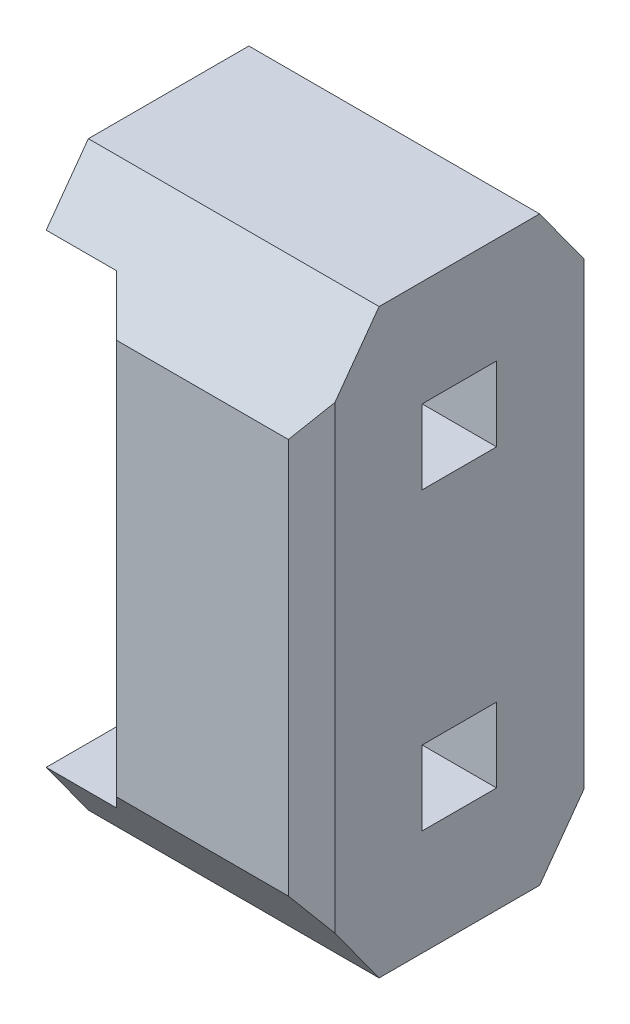
ISO-10303-21;
HEADER;
FILE_DESCRIPTION(('STEP AP214'),'2;1');
FILE_NAME('part.step','',(''),(''),'','','');
FILE_SCHEMA(('AUTOMOTIVE_DESIGN { 1 0 10303 214 1 1 1 1 }'));
ENDSEC;
DATA;
#1=APPLICATION_CONTEXT('core data for automotive mechanical design processes');
#2=APPLICATION_PROTOCOL_DEFINITION('international standard','automotive_design',2000,#1);
#3=PRODUCT_CONTEXT('',#1,'mechanical');
#4=PRODUCT('Part','Part','',(#3));
#5=PRODUCT_RELATED_PRODUCT_CATEGORY('part','',(#4));
#6=PRODUCT_DEFINITION_FORMATION('','',#4);
#7=PRODUCT_DEFINITION_CONTEXT('part definition',#1,'design');
#8=PRODUCT_DEFINITION('design','',#6,#7);
#9=PRODUCT_DEFINITION_SHAPE('','',#8);
#10=(LENGTH_UNIT() NAMED_UNIT(*) SI_UNIT(.MILLI.,.METRE.));
#11=(NAMED_UNIT(*) PLANE_ANGLE_UNIT() SI_UNIT($,.RADIAN.));
#12=(NAMED_UNIT(*) SI_UNIT($,.STERADIAN.) SOLID_ANGLE_UNIT());
#13=UNCERTAINTY_MEASURE_WITH_UNIT(LENGTH_MEASURE(1.E-05),#10,'distance_accuracy_value','');
#14=(GEOMETRIC_REPRESENTATION_CONTEXT(3) GLOBAL_UNCERTAINTY_ASSIGNED_CONTEXT((#13)) GLOBAL_UNIT_ASSIGNED_CONTEXT((#10,
#11,#12)) REPRESENTATION_CONTEXT('',''));
#15=CARTESIAN_POINT('',(0.,0.,0.));
#16=DIRECTION('',(0.,0.,1.));
#17=DIRECTION('',(1.,0.,0.));
#18=AXIS2_PLACEMENT_3D('',#15,#16,#17);
#19=CARTESIAN_POINT('',(1.25,4.6,-23.15));
#20=DIRECTION('',(0.,0.586967571460905,0.809610443394407));
#21=DIRECTION('',(0.,-0.809610443394407,0.586967571460905));
#22=AXIS2_PLACEMENT_3D('',#19,#20,#21);
#23=PLANE('',#22);
#24=DIRECTION('',(1.,0.,0.));
#25=VECTOR('',#24,1.);
#26=CARTESIAN_POINT('',(1.25,4.5,-23.0775));
#27=LINE('',#26,#25);
#28=CARTESIAN_POINT('',(0.,4.5,-23.0775));
#29=VERTEX_POINT('',#28);
#30=CARTESIAN_POINT('',(0.602500000000325,4.5,-23.0775000000001));
#31=VERTEX_POINT('',#30);
#32=EDGE_CURVE('E199',#29,#31,#27,.T.);
#33=ORIENTED_EDGE('',*,*,#32,.T.);
#34=DIRECTION('',(0.506207656348693,-0.698217457033984,0.506207656349605));
#35=VECTOR('',#34,1.);
#36=CARTESIAN_POINT('',(0.6025000000002,4.5,-23.0775));
#37=LINE('',#36,#35);
#38=CARTESIAN_POINT('',(0.819999999999672,4.2,-22.8599999999999));
#39=VERTEX_POINT('',#38);
#40=EDGE_CURVE('E197',#31,#39,#37,.T.);
#41=ORIENTED_EDGE('',*,*,#40,.T.);
#42=DIRECTION('',(1.,0.,0.));
#43=VECTOR('',#42,1.);
#44=CARTESIAN_POINT('',(1.25,4.19999999999999,-22.86));
#45=LINE('',#44,#43);
#46=CARTESIAN_POINT('',(2.30000000000012,4.2,-22.8599999999999));
#47=VERTEX_POINT('',#46);
#48=EDGE_CURVE('E20',#39,#47,#45,.T.);
#49=ORIENTED_EDGE('',*,*,#48,.T.);
#50=DIRECTION('',(0.506207656348955,0.69821745703386,-0.506207656349514));
#51=VECTOR('',#50,1.);
#52=CARTESIAN_POINT('',(2.3,4.19999999999999,-22.86));
#53=LINE('',#52,#51);
#54=CARTESIAN_POINT('',(2.49999999999988,4.47586206896591,-23.0600000000002));
#55=VERTEX_POINT('',#54);
#56=EDGE_CURVE('E181',#47,#55,#53,.T.);
#57=ORIENTED_EDGE('',*,*,#56,.T.);
#58=DIRECTION('',(0.,-0.809610443394407,0.586967571460905));
#59=VECTOR('',#58,1.);
#60=CARTESIAN_POINT('',(2.5,4.6,-23.15));
#61=LINE('',#60,#59);
#62=CARTESIAN_POINT('',(2.5,5.00000000000001,-23.44));
#63=VERTEX_POINT('',#62);
#64=EDGE_CURVE('E188',#55,#63,#61,.F.);
#65=ORIENTED_EDGE('',*,*,#64,.T.);
#66=DIRECTION('',(1.,0.,0.));
#67=VECTOR('',#66,1.);
#68=CARTESIAN_POINT('',(1.25,5.,-23.44));
#69=LINE('',#68,#67);
#70=CARTESIAN_POINT('',(0.,5.00000000000001,-23.44));
#71=VERTEX_POINT('',#70);
#72=EDGE_CURVE('E215',#71,#63,#69,.T.);
#73=ORIENTED_EDGE('',*,*,#72,.F.);
#74=DIRECTION('',(0.,-0.809610443394407,0.586967571460905));
#75=VECTOR('',#74,1.);
#76=CARTESIAN_POINT('',(0.,4.6,-23.15));
#77=LINE('',#76,#75);
#78=EDGE_CURVE('E207',#71,#29,#77,.T.);
#79=ORIENTED_EDGE('',*,*,#78,.T.);
#80=EDGE_LOOP('',(#33,#41,#49,#57,#65,#73,#79));
#81=FACE_BOUND('',#80,.T.);
#82=ADVANCED_FACE('F17',(#81),#23,.T.);
#83=CARTESIAN_POINT('',(1.25,4.6,-25.11));
#84=DIRECTION('',(0.,-0.586967571460905,0.809610443394407));
#85=DIRECTION('',(0.,-0.809610443394407,-0.586967571460905));
#86=AXIS2_PLACEMENT_3D('',#83,#84,#85);
#87=PLANE('',#86);
#88=DIRECTION('',(0.,-0.809610443394407,-0.586967571460905));
#89=VECTOR('',#88,1.);
#90=CARTESIAN_POINT('',(0.,4.6,-25.11));
#91=LINE('',#90,#89);
#92=CARTESIAN_POINT('',(0.,5.,-24.82));
#93=VERTEX_POINT('',#92);
#94=CARTESIAN_POINT('',(0.,4.5,-25.1825));
#95=VERTEX_POINT('',#94);
#96=EDGE_CURVE('E263',#93,#95,#91,.T.);
#97=ORIENTED_EDGE('',*,*,#96,.F.);
#98=DIRECTION('',(1.,0.,0.));
#99=VECTOR('',#98,1.);
#100=CARTESIAN_POINT('',(1.25,5.,-24.82));
#101=LINE('',#100,#99);
#102=CARTESIAN_POINT('',(2.5,5.,-24.82));
#103=VERTEX_POINT('',#102);
#104=EDGE_CURVE('E227',#103,#93,#101,.F.);
#105=ORIENTED_EDGE('',*,*,#104,.F.);
#106=DIRECTION('',(0.,-0.809610443394407,-0.586967571460905));
#107=VECTOR('',#106,1.);
#108=CARTESIAN_POINT('',(2.5,4.6,-25.11));
#109=LINE('',#108,#107);
#110=CARTESIAN_POINT('',(2.49999999999988,4.47586206896591,-25.1999999999998));
#111=VERTEX_POINT('',#110);
#112=EDGE_CURVE('E223',#111,#103,#109,.F.);
#113=ORIENTED_EDGE('',*,*,#112,.F.);
#114=DIRECTION('',(0.506207656348961,0.698217457033859,0.50620765634951));
#115=VECTOR('',#114,1.);
#116=CARTESIAN_POINT('',(2.3,4.19999999999999,-25.4));
#117=LINE('',#116,#115);
#118=CARTESIAN_POINT('',(2.30000000000012,4.2,-25.4000000000001));
#119=VERTEX_POINT('',#118);
#120=EDGE_CURVE('E266',#119,#111,#117,.T.);
#121=ORIENTED_EDGE('',*,*,#120,.F.);
#122=DIRECTION('',(1.,0.,0.));
#123=VECTOR('',#122,1.);
#124=CARTESIAN_POINT('',(1.25,4.19999999999999,-25.4));
#125=LINE('',#124,#123);
#126=CARTESIAN_POINT('',(0.819999999999671,4.2,-25.4000000000001));
#127=VERTEX_POINT('',#126);
#128=EDGE_CURVE('E205',#127,#119,#125,.T.);
#129=ORIENTED_EDGE('',*,*,#128,.F.);
#130=DIRECTION('',(0.506207656348698,-0.698217457033983,-0.506207656349602));
#131=VECTOR('',#130,1.);
#132=CARTESIAN_POINT('',(0.6025000000002,4.5,-25.1825));
#133=LINE('',#132,#131);
#134=CARTESIAN_POINT('',(0.602500000000325,4.5,-25.1824999999999));
#135=VERTEX_POINT('',#134);
#136=EDGE_CURVE('E203',#135,#127,#133,.T.);
#137=ORIENTED_EDGE('',*,*,#136,.F.);
#138=DIRECTION('',(1.,0.,0.));
#139=VECTOR('',#138,1.);
#140=CARTESIAN_POINT('',(1.25,4.5,-25.1825));
#141=LINE('',#140,#139);
#142=EDGE_CURVE('E261',#95,#135,#141,.T.);
#143=ORIENTED_EDGE('',*,*,#142,.F.);
#144=EDGE_LOOP('',(#97,#105,#113,#121,#129,#137,#143));
#145=FACE_BOUND('',#144,.T.);
#146=ADVANCED_FACE('F285',(#145),#87,.F.);
#147=CARTESIAN_POINT('',(1.25,0.4,-25.11));
#148=DIRECTION('',(0.,0.586967571460905,0.809610443394407));
#149=DIRECTION('',(0.,-0.809610443394407,0.586967571460905));
#150=AXIS2_PLACEMENT_3D('',#147,#148,#149);
#151=PLANE('',#150);
#152=DIRECTION('',(-0.506207656349401,0.698217457033646,-0.506207656349363));
#153=VECTOR('',#152,1.);
#154=CARTESIAN_POINT('',(2.5,0.524137931034496,-25.2));
#155=LINE('',#154,#153);
#156=CARTESIAN_POINT('',(2.49999999999988,0.524137931034498,-25.1999999999999));
#157=VERTEX_POINT('',#156);
#158=CARTESIAN_POINT('',(2.30000000000012,0.800000000000005,-25.4000000000001));
#159=VERTEX_POINT('',#158);
#160=EDGE_CURVE('E251',#157,#159,#155,.T.);
#161=ORIENTED_EDGE('',*,*,#160,.F.);
#162=DIRECTION('',(0.,-0.809610443394407,0.586967571460905));
#163=VECTOR('',#162,1.);
#164=CARTESIAN_POINT('',(2.5,0.4,-25.11));
#165=LINE('',#164,#163);
#166=CARTESIAN_POINT('',(2.5,0.,-24.82));
#167=VERTEX_POINT('',#166);
#168=EDGE_CURVE('E253',#167,#157,#165,.F.);
#169=ORIENTED_EDGE('',*,*,#168,.F.);
#170=DIRECTION('',(1.,0.,0.));
#171=VECTOR('',#170,1.);
#172=CARTESIAN_POINT('',(1.25,0.,-24.82));
#173=LINE('',#172,#171);
#174=CARTESIAN_POINT('',(0.,0.,-24.82));
#175=VERTEX_POINT('',#174);
#176=EDGE_CURVE('E288',#167,#175,#173,.F.);
#177=ORIENTED_EDGE('',*,*,#176,.T.);
#178=DIRECTION('',(0.,-0.809610443394407,0.586967571460905));
#179=VECTOR('',#178,1.);
#180=CARTESIAN_POINT('',(0.,0.4,-25.11));
#181=LINE('',#180,#179);
#182=CARTESIAN_POINT('',(0.,0.500000000000001,-25.1825));
#183=VERTEX_POINT('',#182);
#184=EDGE_CURVE('E255',#183,#175,#181,.T.);
#185=ORIENTED_EDGE('',*,*,#184,.F.);
#186=DIRECTION('',(1.,0.,0.));
#187=VECTOR('',#186,1.);
#188=CARTESIAN_POINT('',(1.25,0.500000000000002,-25.1825));
#189=LINE('',#188,#187);
#190=CARTESIAN_POINT('',(0.602500000000325,0.500000000000001,-25.1824999999999));
#191=VERTEX_POINT('',#190);
#192=EDGE_CURVE('E257',#191,#183,#189,.F.);
#193=ORIENTED_EDGE('',*,*,#192,.F.);
#194=DIRECTION('',(-0.506207656348694,-0.698217457033983,0.506207656349606));
#195=VECTOR('',#194,1.);
#196=CARTESIAN_POINT('',(0.8199999999998,0.80000000000001,-25.4));
#197=LINE('',#196,#195);
#198=CARTESIAN_POINT('',(0.819999999999671,0.800000000000005,-25.4000000000001));
#199=VERTEX_POINT('',#198);
#200=EDGE_CURVE('E259',#199,#191,#197,.T.);
#201=ORIENTED_EDGE('',*,*,#200,.F.);
#202=DIRECTION('',(1.,0.,0.));
#203=VECTOR('',#202,1.);
#204=CARTESIAN_POINT('',(1.25,0.80000000000001,-25.4));
#205=LINE('',#204,#203);
#206=EDGE_CURVE('E249',#159,#199,#205,.F.);
#207=ORIENTED_EDGE('',*,*,#206,.F.);
#208=EDGE_LOOP('',(#161,#169,#177,#185,#193,#201,#207));
#209=FACE_BOUND('',#208,.T.);
#210=ADVANCED_FACE('F431',(#209),#151,.F.);
#211=CARTESIAN_POINT('',(1.25,0.4,-23.15));
#212=DIRECTION('',(0.,-0.586967571460905,0.809610443394407));
#213=DIRECTION('',(0.,-0.809610443394407,-0.586967571460905));
#214=AXIS2_PLACEMENT_3D('',#211,#212,#213);
#215=PLANE('',#214);
#216=DIRECTION('',(1.,0.,0.));
#217=VECTOR('',#216,1.);
#218=CARTESIAN_POINT('',(1.25,0.800000000000011,-22.86));
#219=LINE('',#218,#217);
#220=CARTESIAN_POINT('',(2.30000000000012,0.800000000000005,-22.8599999999999));
#221=VERTEX_POINT('',#220);
#222=CARTESIAN_POINT('',(0.819999999999672,0.800000000000005,-22.8599999999999));
#223=VERTEX_POINT('',#222);
#224=EDGE_CURVE('E191',#221,#223,#219,.F.);
#225=ORIENTED_EDGE('',*,*,#224,.T.);
#226=DIRECTION('',(-0.506207656348693,-0.698217457033984,-0.506207656349605));
#227=VECTOR('',#226,1.);
#228=CARTESIAN_POINT('',(0.8199999999998,0.800000000000011,-22.86));
#229=LINE('',#228,#227);
#230=CARTESIAN_POINT('',(0.602500000000325,0.500000000000001,-23.0775000000001));
#231=VERTEX_POINT('',#230);
#232=EDGE_CURVE('E232',#223,#231,#229,.T.);
#233=ORIENTED_EDGE('',*,*,#232,.T.);
#234=DIRECTION('',(1.,0.,0.));
#235=VECTOR('',#234,1.);
#236=CARTESIAN_POINT('',(1.25,0.500000000000002,-23.0775));
#237=LINE('',#236,#235);
#238=CARTESIAN_POINT('',(0.,0.500000000000001,-23.0775));
#239=VERTEX_POINT('',#238);
#240=EDGE_CURVE('E246',#231,#239,#237,.F.);
#241=ORIENTED_EDGE('',*,*,#240,.T.);
#242=DIRECTION('',(0.,-0.809610443394407,-0.586967571460905));
#243=VECTOR('',#242,1.);
#244=CARTESIAN_POINT('',(0.,0.4,-23.15));
#245=LINE('',#244,#243);
#246=CARTESIAN_POINT('',(0.,0.,-23.44));
#247=VERTEX_POINT('',#246);
#248=EDGE_CURVE('E244',#239,#247,#245,.T.);
#249=ORIENTED_EDGE('',*,*,#248,.T.);
#250=DIRECTION('',(1.,0.,0.));
#251=VECTOR('',#250,1.);
#252=CARTESIAN_POINT('',(1.25,0.,-23.44));
#253=LINE('',#252,#251);
#254=CARTESIAN_POINT('',(2.5,0.,-23.44));
#255=VERTEX_POINT('',#254);
#256=EDGE_CURVE('E293',#247,#255,#253,.T.);
#257=ORIENTED_EDGE('',*,*,#256,.T.);
#258=DIRECTION('',(0.,-0.809610443394407,-0.586967571460905));
#259=VECTOR('',#258,1.);
#260=CARTESIAN_POINT('',(2.5,0.4,-23.15));
#261=LINE('',#260,#259);
#262=CARTESIAN_POINT('',(2.49999999999988,0.524137931034498,-23.0600000000001));
#263=VERTEX_POINT('',#262);
#264=EDGE_CURVE('E241',#255,#263,#261,.F.);
#265=ORIENTED_EDGE('',*,*,#264,.T.);
#266=DIRECTION('',(-0.5062076563494,0.698217457033648,0.506207656349362));
#267=VECTOR('',#266,1.);
#268=CARTESIAN_POINT('',(2.5,0.524137931034496,-23.06));
#269=LINE('',#268,#267);
#270=EDGE_CURVE('E239',#263,#221,#269,.T.);
#271=ORIENTED_EDGE('',*,*,#270,.T.);
#272=EDGE_LOOP('',(#225,#233,#241,#249,#257,#265,#271));
#273=FACE_BOUND('',#272,.T.);
#274=ADVANCED_FACE('F421',(#273),#215,.T.);
#275=CARTESIAN_POINT('',(1.25,5.,-24.13));
#276=DIRECTION('',(0.,1.,0.));
#277=DIRECTION('',(0.,0.,1.));
#278=AXIS2_PLACEMENT_3D('',#275,#276,#277);
#279=PLANE('',#278);
#280=ORIENTED_EDGE('',*,*,#104,.T.);
#281=DIRECTION('',(0.,0.,-1.));
#282=VECTOR('',#281,1.);
#283=CARTESIAN_POINT('',(0.,5.,-24.13));
#284=LINE('',#283,#282);
#285=EDGE_CURVE('E231',#93,#71,#284,.F.);
#286=ORIENTED_EDGE('',*,*,#285,.T.);
#287=ORIENTED_EDGE('',*,*,#72,.T.);
#288=DIRECTION('',(0.,0.,1.));
#289=VECTOR('',#288,1.);
#290=CARTESIAN_POINT('',(2.5,5.,-24.13));
#291=LINE('',#290,#289);
#292=EDGE_CURVE('E219',#63,#103,#291,.F.);
#293=ORIENTED_EDGE('',*,*,#292,.T.);
#294=EDGE_LOOP('',(#280,#286,#287,#293));
#295=FACE_BOUND('',#294,.T.);
#296=ADVANCED_FACE('F229',(#295),#279,.T.);
#297=CARTESIAN_POINT('',(1.25,0.,-24.13));
#298=DIRECTION('',(0.,1.,0.));
#299=DIRECTION('',(0.,0.,1.));
#300=AXIS2_PLACEMENT_3D('',#297,#298,#299);
#301=PLANE('',#300);
#302=DIRECTION('',(0.,0.,-1.));
#303=VECTOR('',#302,1.);
#304=CARTESIAN_POINT('',(0.,0.,-24.13));
#305=LINE('',#304,#303);
#306=EDGE_CURVE('E297',#247,#175,#305,.T.);
#307=ORIENTED_EDGE('',*,*,#306,.T.);
#308=ORIENTED_EDGE('',*,*,#176,.F.);
#309=DIRECTION('',(0.,0.,1.));
#310=VECTOR('',#309,1.);
#311=CARTESIAN_POINT('',(2.5,0.,-24.13));
#312=LINE('',#311,#310);
#313=EDGE_CURVE('E287',#255,#167,#312,.F.);
#314=ORIENTED_EDGE('',*,*,#313,.F.);
#315=ORIENTED_EDGE('',*,*,#256,.F.);
#316=EDGE_LOOP('',(#307,#308,#314,#315));
#317=FACE_BOUND('',#316,.T.);
#318=ADVANCED_FACE('F428',(#317),#301,.F.);
#319=CARTESIAN_POINT('',(0.,4.75,-24.13));
#320=DIRECTION('',(1.,0.,0.));
#321=DIRECTION('',(0.,0.,-1.));
#322=AXIS2_PLACEMENT_3D('',#319,#320,#321);
#323=PLANE('',#322);
#324=ORIENTED_EDGE('',*,*,#285,.F.);
#325=ORIENTED_EDGE('',*,*,#96,.T.);
#326=DIRECTION('',(0.,0.,1.));
#327=VECTOR('',#326,1.);
#328=CARTESIAN_POINT('',(0.,4.5,-24.13));
#329=LINE('',#328,#327);
#330=EDGE_CURVE('E307',#95,#29,#329,.T.);
#331=ORIENTED_EDGE('',*,*,#330,.T.);
#332=ORIENTED_EDGE('',*,*,#78,.F.);
#333=EDGE_LOOP('',(#324,#325,#331,#332));
#334=FACE_BOUND('',#333,.T.);
#335=ADVANCED_FACE('F441',(#334),#323,.F.);
#336=CARTESIAN_POINT('',(0.,0.25,-24.13));
#337=DIRECTION('',(1.,0.,0.));
#338=DIRECTION('',(0.,0.,-1.));
#339=AXIS2_PLACEMENT_3D('',#336,#337,#338);
#340=PLANE('',#339);
#341=ORIENTED_EDGE('',*,*,#306,.F.);
#342=ORIENTED_EDGE('',*,*,#248,.F.);
#343=DIRECTION('',(0.,0.,1.));
#344=VECTOR('',#343,1.);
#345=CARTESIAN_POINT('',(0.,0.5,-24.13));
#346=LINE('',#345,#344);
#347=EDGE_CURVE('E315',#183,#239,#346,.T.);
#348=ORIENTED_EDGE('',*,*,#347,.F.);
#349=ORIENTED_EDGE('',*,*,#184,.T.);
#350=EDGE_LOOP('',(#341,#342,#348,#349));
#351=FACE_BOUND('',#350,.T.);
#352=ADVANCED_FACE('F443',(#351),#340,.F.);
#353=CARTESIAN_POINT('',(1.55,3.45,-24.13));
#354=DIRECTION('',(0.,1.,0.));
#355=DIRECTION('',(0.,0.,1.));
#356=AXIS2_PLACEMENT_3D('',#353,#354,#355);
#357=PLANE('',#356);
#358=DIRECTION('',(1.,0.,0.));
#359=VECTOR('',#358,1.);
#360=CARTESIAN_POINT('',(1.55,3.45,-24.45));
#361=LINE('',#360,#359);
#362=CARTESIAN_POINT('',(0.6,3.45,-24.45));
#363=VERTEX_POINT('',#362);
#364=CARTESIAN_POINT('',(2.5,3.45,-24.45));
#365=VERTEX_POINT('',#364);
#366=EDGE_CURVE('E332',#363,#365,#361,.T.);
#367=ORIENTED_EDGE('',*,*,#366,.F.);
#368=DIRECTION('',(0.,0.,1.));
#369=VECTOR('',#368,1.);
#370=CARTESIAN_POINT('',(0.6,3.45,-24.13));
#371=LINE('',#370,#369);
#372=CARTESIAN_POINT('',(0.6,3.45,-23.81));
#373=VERTEX_POINT('',#372);
#374=EDGE_CURVE('E302',#363,#373,#371,.T.);
#375=ORIENTED_EDGE('',*,*,#374,.T.);
#376=DIRECTION('',(1.,0.,0.));
#377=VECTOR('',#376,1.);
#378=CARTESIAN_POINT('',(1.55,3.45,-23.81));
#379=LINE('',#378,#377);
#380=CARTESIAN_POINT('',(2.5,3.45,-23.81));
#381=VERTEX_POINT('',#380);
#382=EDGE_CURVE('E327',#373,#381,#379,.T.);
#383=ORIENTED_EDGE('',*,*,#382,.T.);
#384=DIRECTION('',(0.,0.,1.));
#385=VECTOR('',#384,1.);
#386=CARTESIAN_POINT('',(2.5,3.45,-24.13));
#387=LINE('',#386,#385);
#388=EDGE_CURVE('E300',#381,#365,#387,.F.);
#389=ORIENTED_EDGE('',*,*,#388,.T.);
#390=EDGE_LOOP('',(#367,#375,#383,#389));
#391=FACE_BOUND('',#390,.T.);
#392=ADVANCED_FACE('F398',(#391),#357,.T.);
#393=CARTESIAN_POINT('',(0.71,2.5,-25.29));
#394=DIRECTION('',(0.707106781190498,0.,0.707106781182598));
#395=DIRECTION('',(0.707106781182598,0.,-0.707106781190498));
#396=AXIS2_PLACEMENT_3D('',#393,#394,#395);
#397=PLANE('',#396);
#398=ORIENTED_EDGE('',*,*,#200,.T.);
#399=DIRECTION('',(0.70710678118667,0.,-0.707106781186425));
#400=VECTOR('',#399,1.);
#401=CARTESIAN_POINT('',(0.6000000000002,0.5,-25.18));
#402=LINE('',#401,#400);
#403=CARTESIAN_POINT('',(0.600000000000408,0.5,-25.1799999999997));
#404=VERTEX_POINT('',#403);
#405=EDGE_CURVE('E312',#404,#191,#402,.T.);
#406=ORIENTED_EDGE('',*,*,#405,.F.);
#407=DIRECTION('',(0.,1.,0.));
#408=VECTOR('',#407,1.);
#409=CARTESIAN_POINT('',(0.6,2.5,-25.18));
#410=LINE('',#409,#408);
#411=CARTESIAN_POINT('',(0.600000000000408,4.5,-25.1799999999997));
#412=VERTEX_POINT('',#411);
#413=EDGE_CURVE('E337',#404,#412,#410,.T.);
#414=ORIENTED_EDGE('',*,*,#413,.T.);
#415=DIRECTION('',(0.70710678118667,0.,-0.707106781186425));
#416=VECTOR('',#415,1.);
#417=CARTESIAN_POINT('',(0.6000000000002,4.5,-25.18));
#418=LINE('',#417,#416);
#419=EDGE_CURVE('E304',#412,#135,#418,.T.);
#420=ORIENTED_EDGE('',*,*,#419,.T.);
#421=ORIENTED_EDGE('',*,*,#136,.T.);
#422=DIRECTION('',(0.,1.,0.));
#423=VECTOR('',#422,1.);
#424=CARTESIAN_POINT('',(0.8199999999998,2.5,-25.4));
#425=LINE('',#424,#423);
#426=EDGE_CURVE('E275',#127,#199,#425,.F.);
#427=ORIENTED_EDGE('',*,*,#426,.T.);
#428=EDGE_LOOP('',(#398,#406,#414,#420,#421,#427));
#429=FACE_BOUND('',#428,.T.);
#430=ADVANCED_FACE('F435',(#429),#397,.F.);
#431=CARTESIAN_POINT('',(0.30125,4.5,-24.13));
#432=DIRECTION('',(0.,1.,0.));
#433=DIRECTION('',(0.,0.,1.));
#434=AXIS2_PLACEMENT_3D('',#431,#432,#433);
#435=PLANE('',#434);
#436=ORIENTED_EDGE('',*,*,#142,.T.);
#437=ORIENTED_EDGE('',*,*,#419,.F.);
#438=DIRECTION('',(0.,0.,-1.));
#439=VECTOR('',#438,1.);
#440=CARTESIAN_POINT('',(0.6,4.5,-24.13));
#441=LINE('',#440,#439);
#442=CARTESIAN_POINT('',(0.600000000000279,4.5,-23.0800000000001));
#443=VERTEX_POINT('',#442);
#444=EDGE_CURVE('E339',#412,#443,#441,.F.);
#445=ORIENTED_EDGE('',*,*,#444,.T.);
#446=DIRECTION('',(-0.707106781182598,0.,-0.707106781190498));
#447=VECTOR('',#446,1.);
#448=CARTESIAN_POINT('',(0.71,4.5,-22.97));
#449=LINE('',#448,#447);
#450=EDGE_CURVE('E310',#443,#31,#449,.F.);
#451=ORIENTED_EDGE('',*,*,#450,.T.);
#452=ORIENTED_EDGE('',*,*,#32,.F.);
#453=ORIENTED_EDGE('',*,*,#330,.F.);
#454=EDGE_LOOP('',(#436,#437,#445,#451,#452,#453));
#455=FACE_BOUND('',#454,.T.);
#456=ADVANCED_FACE('F439',(#455),#435,.F.);
#457=CARTESIAN_POINT('',(0.71,2.5,-22.97));
#458=DIRECTION('',(0.707106781190498,0.,-0.707106781182598));
#459=DIRECTION('',(-0.707106781182598,0.,-0.707106781190498));
#460=AXIS2_PLACEMENT_3D('',#457,#458,#459);
#461=PLANE('',#460);
#462=ORIENTED_EDGE('',*,*,#232,.F.);
#463=DIRECTION('',(0.,1.,0.));
#464=VECTOR('',#463,1.);
#465=CARTESIAN_POINT('',(0.8199999999998,2.5,-22.86));
#466=LINE('',#465,#464);
#467=EDGE_CURVE('E325',#39,#223,#466,.F.);
#468=ORIENTED_EDGE('',*,*,#467,.F.);
#469=ORIENTED_EDGE('',*,*,#40,.F.);
#470=ORIENTED_EDGE('',*,*,#450,.F.);
#471=DIRECTION('',(0.,1.,0.));
#472=VECTOR('',#471,1.);
#473=CARTESIAN_POINT('',(0.6,2.5,-23.08));
#474=LINE('',#473,#472);
#475=CARTESIAN_POINT('',(0.600000000000408,0.5,-23.0800000000003));
#476=VERTEX_POINT('',#475);
#477=EDGE_CURVE('E341',#443,#476,#474,.F.);
#478=ORIENTED_EDGE('',*,*,#477,.T.);
#479=DIRECTION('',(-0.70710678118667,0.,-0.707106781186425));
#480=VECTOR('',#479,1.);
#481=CARTESIAN_POINT('',(0.6025000000002,0.5,-23.0775));
#482=LINE('',#481,#480);
#483=EDGE_CURVE('E318',#231,#476,#482,.T.);
#484=ORIENTED_EDGE('',*,*,#483,.F.);
#485=EDGE_LOOP('',(#462,#468,#469,#470,#478,#484));
#486=FACE_BOUND('',#485,.T.);
#487=ADVANCED_FACE('F416',(#486),#461,.F.);
#488=CARTESIAN_POINT('',(0.30125,0.5,-24.13));
#489=DIRECTION('',(0.,1.,0.));
#490=DIRECTION('',(0.,0.,1.));
#491=AXIS2_PLACEMENT_3D('',#488,#489,#490);
#492=PLANE('',#491);
#493=ORIENTED_EDGE('',*,*,#483,.T.);
#494=DIRECTION('',(0.,0.,-1.));
#495=VECTOR('',#494,1.);
#496=CARTESIAN_POINT('',(0.6,0.5,-24.13));
#497=LINE('',#496,#495);
#498=EDGE_CURVE('E343',#476,#404,#497,.T.);
#499=ORIENTED_EDGE('',*,*,#498,.T.);
#500=ORIENTED_EDGE('',*,*,#405,.T.);
#501=ORIENTED_EDGE('',*,*,#192,.T.);
#502=ORIENTED_EDGE('',*,*,#347,.T.);
#503=ORIENTED_EDGE('',*,*,#240,.F.);
#504=EDGE_LOOP('',(#493,#499,#500,#501,#502,#503));
#505=FACE_BOUND('',#504,.T.);
#506=ADVANCED_FACE('F418',(#505),#492,.T.);
#507=CARTESIAN_POINT('',(1.55,1.23,-24.45));
#508=DIRECTION('',(0.,0.,1.));
#509=DIRECTION('',(1.,0.,0.));
#510=AXIS2_PLACEMENT_3D('',#507,#508,#509);
#511=PLANE('',#510);
#512=DIRECTION('',(1.,0.,0.));
#513=VECTOR('',#512,1.);
#514=CARTESIAN_POINT('',(1.55,1.55,-24.45));
#515=LINE('',#514,#513);
#516=CARTESIAN_POINT('',(2.5,1.55,-24.45));
#517=VERTEX_POINT('',#516);
#518=CARTESIAN_POINT('',(0.6,1.55,-24.45));
#519=VERTEX_POINT('',#518);
#520=EDGE_CURVE('E283',#517,#519,#515,.F.);
#521=ORIENTED_EDGE('',*,*,#520,.T.);
#522=DIRECTION('',(0.,1.,0.));
#523=VECTOR('',#522,1.);
#524=CARTESIAN_POINT('',(0.6,2.5,-24.45));
#525=LINE('',#524,#523);
#526=CARTESIAN_POINT('',(0.6,0.91,-24.45));
#527=VERTEX_POINT('',#526);
#528=EDGE_CURVE('E346',#519,#527,#525,.F.);
#529=ORIENTED_EDGE('',*,*,#528,.T.);
#530=DIRECTION('',(1.,0.,0.));
#531=VECTOR('',#530,1.);
#532=CARTESIAN_POINT('',(1.55,0.91,-24.45));
#533=LINE('',#532,#531);
#534=CARTESIAN_POINT('',(2.5,0.91,-24.45));
#535=VERTEX_POINT('',#534);
#536=EDGE_CURVE('E354',#535,#527,#533,.F.);
#537=ORIENTED_EDGE('',*,*,#536,.F.);
#538=DIRECTION('',(0.,1.,0.));
#539=VECTOR('',#538,1.);
#540=CARTESIAN_POINT('',(2.5,1.23,-24.45));
#541=LINE('',#540,#539);
#542=EDGE_CURVE('E321',#535,#517,#541,.T.);
#543=ORIENTED_EDGE('',*,*,#542,.T.);
#544=EDGE_LOOP('',(#521,#529,#537,#543));
#545=FACE_BOUND('',#544,.T.);
#546=ADVANCED_FACE('F483',(#545),#511,.T.);
#547=CARTESIAN_POINT('',(1.56,2.5,-25.4));
#548=DIRECTION('',(0.,0.,1.));
#549=DIRECTION('',(1.,0.,0.));
#550=AXIS2_PLACEMENT_3D('',#547,#548,#549);
#551=PLANE('',#550);
#552=DIRECTION('',(0.,1.,0.));
#553=VECTOR('',#552,1.);
#554=CARTESIAN_POINT('',(2.30000000000047,2.5,-25.4000000000005));
#555=LINE('',#554,#553);
#556=EDGE_CURVE('E193',#159,#119,#555,.T.);
#557=ORIENTED_EDGE('',*,*,#556,.F.);
#558=ORIENTED_EDGE('',*,*,#206,.T.);
#559=ORIENTED_EDGE('',*,*,#426,.F.);
#560=ORIENTED_EDGE('',*,*,#128,.T.);
#561=EDGE_LOOP('',(#557,#558,#559,#560));
#562=FACE_BOUND('',#561,.T.);
#563=ADVANCED_FACE('F272',(#562),#551,.F.);
#564=CARTESIAN_POINT('',(1.56,2.5,-22.86));
#565=DIRECTION('',(0.,0.,1.));
#566=DIRECTION('',(1.,0.,0.));
#567=AXIS2_PLACEMENT_3D('',#564,#565,#566);
#568=PLANE('',#567);
#569=ORIENTED_EDGE('',*,*,#48,.F.);
#570=ORIENTED_EDGE('',*,*,#467,.T.);
#571=ORIENTED_EDGE('',*,*,#224,.F.);
#572=DIRECTION('',(0.,1.,0.));
#573=VECTOR('',#572,1.);
#574=CARTESIAN_POINT('',(2.30000000000047,2.5,-22.8599999999995));
#575=LINE('',#574,#573);
#576=EDGE_CURVE('E183',#47,#221,#575,.F.);
#577=ORIENTED_EDGE('',*,*,#576,.F.);
#578=EDGE_LOOP('',(#569,#570,#571,#577));
#579=FACE_BOUND('',#578,.T.);
#580=ADVANCED_FACE('F189',(#579),#568,.T.);
#581=CARTESIAN_POINT('',(1.55,3.77,-23.81));
#582=DIRECTION('',(0.,0.,1.));
#583=DIRECTION('',(1.,0.,0.));
#584=AXIS2_PLACEMENT_3D('',#581,#582,#583);
#585=PLANE('',#584);
#586=DIRECTION('',(0.,1.,0.));
#587=VECTOR('',#586,1.);
#588=CARTESIAN_POINT('',(2.5,3.77,-23.81));
#589=LINE('',#588,#587);
#590=CARTESIAN_POINT('',(2.5,4.09,-23.81));
#591=VERTEX_POINT('',#590);
#592=EDGE_CURVE('E330',#381,#591,#589,.T.);
#593=ORIENTED_EDGE('',*,*,#592,.F.);
#594=ORIENTED_EDGE('',*,*,#382,.F.);
#595=DIRECTION('',(0.,1.,0.));
#596=VECTOR('',#595,1.);
#597=CARTESIAN_POINT('',(0.6,2.5,-23.81));
#598=LINE('',#597,#596);
#599=CARTESIAN_POINT('',(0.6,4.09,-23.81));
#600=VERTEX_POINT('',#599);
#601=EDGE_CURVE('E351',#373,#600,#598,.T.);
#602=ORIENTED_EDGE('',*,*,#601,.T.);
#603=DIRECTION('',(1.,0.,0.));
#604=VECTOR('',#603,1.);
#605=CARTESIAN_POINT('',(1.55,4.09,-23.81));
#606=LINE('',#605,#604);
#607=EDGE_CURVE('E368',#600,#591,#606,.T.);
#608=ORIENTED_EDGE('',*,*,#607,.T.);
#609=EDGE_LOOP('',(#593,#594,#602,#608));
#610=FACE_BOUND('',#609,.T.);
#611=ADVANCED_FACE('F402',(#610),#585,.F.);
#612=CARTESIAN_POINT('',(1.55,3.77,-24.45));
#613=DIRECTION('',(0.,0.,1.));
#614=DIRECTION('',(1.,0.,0.));
#615=AXIS2_PLACEMENT_3D('',#612,#613,#614);
#616=PLANE('',#615);
#617=DIRECTION('',(1.,0.,0.));
#618=VECTOR('',#617,1.);
#619=CARTESIAN_POINT('',(1.55,4.09,-24.45));
#620=LINE('',#619,#618);
#621=CARTESIAN_POINT('',(2.5,4.09,-24.45));
#622=VERTEX_POINT('',#621);
#623=CARTESIAN_POINT('',(0.6,4.09,-24.45));
#624=VERTEX_POINT('',#623);
#625=EDGE_CURVE('E371',#622,#624,#620,.F.);
#626=ORIENTED_EDGE('',*,*,#625,.T.);
#627=DIRECTION('',(0.,1.,0.));
#628=VECTOR('',#627,1.);
#629=CARTESIAN_POINT('',(0.6,2.5,-24.45));
#630=LINE('',#629,#628);
#631=EDGE_CURVE('E348',#624,#363,#630,.F.);
#632=ORIENTED_EDGE('',*,*,#631,.T.);
#633=ORIENTED_EDGE('',*,*,#366,.T.);
#634=DIRECTION('',(0.,1.,0.));
#635=VECTOR('',#634,1.);
#636=CARTESIAN_POINT('',(2.5,3.77,-24.45));
#637=LINE('',#636,#635);
#638=EDGE_CURVE('E335',#365,#622,#637,.T.);
#639=ORIENTED_EDGE('',*,*,#638,.T.);
#640=EDGE_LOOP('',(#626,#632,#633,#639));
#641=FACE_BOUND('',#640,.T.);
#642=ADVANCED_FACE('F395',(#641),#616,.T.);
#643=CARTESIAN_POINT('',(0.6,2.5,-24.13));
#644=DIRECTION('',(1.,0.,0.));
#645=DIRECTION('',(0.,0.,-1.));
#646=AXIS2_PLACEMENT_3D('',#643,#644,#645);
#647=PLANE('',#646);
#648=ORIENTED_EDGE('',*,*,#374,.F.);
#649=ORIENTED_EDGE('',*,*,#631,.F.);
#650=DIRECTION('',(0.,0.,1.));
#651=VECTOR('',#650,1.);
#652=CARTESIAN_POINT('',(0.6,4.09,-24.13));
#653=LINE('',#652,#651);
#654=EDGE_CURVE('E192',#624,#600,#653,.T.);
#655=ORIENTED_EDGE('',*,*,#654,.T.);
#656=ORIENTED_EDGE('',*,*,#601,.F.);
#657=EDGE_LOOP('',(#648,#649,#655,#656));
#658=FACE_BOUND('',#657,.T.);
#659=ORIENTED_EDGE('',*,*,#528,.F.);
#660=DIRECTION('',(0.,0.,1.));
#661=VECTOR('',#660,1.);
#662=CARTESIAN_POINT('',(0.6,1.55,-24.13));
#663=LINE('',#662,#661);
#664=CARTESIAN_POINT('',(0.6,1.55,-23.81));
#665=VERTEX_POINT('',#664);
#666=EDGE_CURVE('E360',#519,#665,#663,.T.);
#667=ORIENTED_EDGE('',*,*,#666,.T.);
#668=DIRECTION('',(0.,1.,0.));
#669=VECTOR('',#668,1.);
#670=CARTESIAN_POINT('',(0.6,1.23,-23.81));
#671=LINE('',#670,#669);
#672=CARTESIAN_POINT('',(0.6,0.91,-23.81));
#673=VERTEX_POINT('',#672);
#674=EDGE_CURVE('E374',#665,#673,#671,.F.);
#675=ORIENTED_EDGE('',*,*,#674,.T.);
#676=DIRECTION('',(0.,0.,1.));
#677=VECTOR('',#676,1.);
#678=CARTESIAN_POINT('',(0.6,0.91,-24.13));
#679=LINE('',#678,#677);
#680=EDGE_CURVE('E357',#527,#673,#679,.T.);
#681=ORIENTED_EDGE('',*,*,#680,.F.);
#682=EDGE_LOOP('',(#659,#667,#675,#681));
#683=FACE_BOUND('',#682,.T.);
#684=ORIENTED_EDGE('',*,*,#477,.F.);
#685=ORIENTED_EDGE('',*,*,#444,.F.);
#686=ORIENTED_EDGE('',*,*,#413,.F.);
#687=ORIENTED_EDGE('',*,*,#498,.F.);
#688=EDGE_LOOP('',(#684,#685,#686,#687));
#689=FACE_BOUND('',#688,.T.);
#690=ADVANCED_FACE('F404',(#658,#683,#689),#647,.F.);
#691=CARTESIAN_POINT('',(1.55,0.91,-24.13));
#692=DIRECTION('',(0.,1.,0.));
#693=DIRECTION('',(0.,0.,1.));
#694=AXIS2_PLACEMENT_3D('',#691,#692,#693);
#695=PLANE('',#694);
#696=ORIENTED_EDGE('',*,*,#536,.T.);
#697=ORIENTED_EDGE('',*,*,#680,.T.);
#698=DIRECTION('',(1.,0.,0.));
#699=VECTOR('',#698,1.);
#700=CARTESIAN_POINT('',(1.55,0.91,-23.81));
#701=LINE('',#700,#699);
#702=CARTESIAN_POINT('',(2.5,0.91,-23.81));
#703=VERTEX_POINT('',#702);
#704=EDGE_CURVE('E376',#673,#703,#701,.T.);
#705=ORIENTED_EDGE('',*,*,#704,.T.);
#706=DIRECTION('',(0.,0.,1.));
#707=VECTOR('',#706,1.);
#708=CARTESIAN_POINT('',(2.5,0.91,-24.13));
#709=LINE('',#708,#707);
#710=EDGE_CURVE('E34',#703,#535,#709,.F.);
#711=ORIENTED_EDGE('',*,*,#710,.T.);
#712=EDGE_LOOP('',(#696,#697,#705,#711));
#713=FACE_BOUND('',#712,.T.);
#714=ADVANCED_FACE('F407',(#713),#695,.T.);
#715=CARTESIAN_POINT('',(1.55,1.55,-24.13));
#716=DIRECTION('',(0.,1.,0.));
#717=DIRECTION('',(0.,0.,1.));
#718=AXIS2_PLACEMENT_3D('',#715,#716,#717);
#719=PLANE('',#718);
#720=DIRECTION('',(0.,0.,1.));
#721=VECTOR('',#720,1.);
#722=CARTESIAN_POINT('',(2.5,1.55,-24.13));
#723=LINE('',#722,#721);
#724=CARTESIAN_POINT('',(2.5,1.55,-23.81));
#725=VERTEX_POINT('',#724);
#726=EDGE_CURVE('E362',#725,#517,#723,.F.);
#727=ORIENTED_EDGE('',*,*,#726,.F.);
#728=DIRECTION('',(1.,0.,0.));
#729=VECTOR('',#728,1.);
#730=CARTESIAN_POINT('',(1.55,1.55,-23.81));
#731=LINE('',#730,#729);
#732=EDGE_CURVE('E378',#725,#665,#731,.F.);
#733=ORIENTED_EDGE('',*,*,#732,.T.);
#734=ORIENTED_EDGE('',*,*,#666,.F.);
#735=ORIENTED_EDGE('',*,*,#520,.F.);
#736=EDGE_LOOP('',(#727,#733,#734,#735));
#737=FACE_BOUND('',#736,.T.);
#738=ADVANCED_FACE('F468',(#737),#719,.F.);
#739=CARTESIAN_POINT('',(2.4,2.5,-25.3));
#740=DIRECTION('',(0.707106781189898,0.,-0.707106781183198));
#741=DIRECTION('',(-0.707106781183198,0.,-0.707106781189898));
#742=AXIS2_PLACEMENT_3D('',#739,#740,#741);
#743=PLANE('',#742);
#744=DIRECTION('',(0.,1.,0.));
#745=VECTOR('',#744,1.);
#746=CARTESIAN_POINT('',(2.5,2.5,-25.2));
#747=LINE('',#746,#745);
#748=EDGE_CURVE('E381',#157,#111,#747,.T.);
#749=ORIENTED_EDGE('',*,*,#748,.F.);
#750=ORIENTED_EDGE('',*,*,#160,.T.);
#751=ORIENTED_EDGE('',*,*,#556,.T.);
#752=ORIENTED_EDGE('',*,*,#120,.T.);
#753=EDGE_LOOP('',(#749,#750,#751,#752));
#754=FACE_BOUND('',#753,.T.);
#755=ADVANCED_FACE('F281',(#754),#743,.T.);
#756=CARTESIAN_POINT('',(2.4,2.5,-22.96));
#757=DIRECTION('',(0.707106781189898,0.,0.707106781183198));
#758=DIRECTION('',(0.707106781183198,0.,-0.707106781189898));
#759=AXIS2_PLACEMENT_3D('',#756,#757,#758);
#760=PLANE('',#759);
#761=DIRECTION('',(0.,1.,0.));
#762=VECTOR('',#761,1.);
#763=CARTESIAN_POINT('',(2.5,2.5,-23.06));
#764=LINE('',#763,#762);
#765=EDGE_CURVE('E186',#55,#263,#764,.F.);
#766=ORIENTED_EDGE('',*,*,#765,.F.);
#767=ORIENTED_EDGE('',*,*,#56,.F.);
#768=ORIENTED_EDGE('',*,*,#576,.T.);
#769=ORIENTED_EDGE('',*,*,#270,.F.);
#770=EDGE_LOOP('',(#766,#767,#768,#769));
#771=FACE_BOUND('',#770,.T.);
#772=ADVANCED_FACE('F182',(#771),#760,.T.);
#773=CARTESIAN_POINT('',(1.55,4.09,-24.13));
#774=DIRECTION('',(0.,1.,0.));
#775=DIRECTION('',(0.,0.,1.));
#776=AXIS2_PLACEMENT_3D('',#773,#774,#775);
#777=PLANE('',#776);
#778=DIRECTION('',(0.,0.,-1.));
#779=VECTOR('',#778,1.);
#780=CARTESIAN_POINT('',(2.5,4.09,-24.13));
#781=LINE('',#780,#779);
#782=EDGE_CURVE('E26',#591,#622,#781,.T.);
#783=ORIENTED_EDGE('',*,*,#782,.F.);
#784=ORIENTED_EDGE('',*,*,#607,.F.);
#785=ORIENTED_EDGE('',*,*,#654,.F.);
#786=ORIENTED_EDGE('',*,*,#625,.F.);
#787=EDGE_LOOP('',(#783,#784,#785,#786));
#788=FACE_BOUND('',#787,.T.);
#789=ADVANCED_FACE('F392',(#788),#777,.F.);
#790=CARTESIAN_POINT('',(1.55,1.23,-23.81));
#791=DIRECTION('',(0.,0.,1.));
#792=DIRECTION('',(1.,0.,0.));
#793=AXIS2_PLACEMENT_3D('',#790,#791,#792);
#794=PLANE('',#793);
#795=DIRECTION('',(0.,1.,0.));
#796=VECTOR('',#795,1.);
#797=CARTESIAN_POINT('',(2.5,2.5,-23.81));
#798=LINE('',#797,#796);
#799=EDGE_CURVE('E11',#703,#725,#798,.T.);
#800=ORIENTED_EDGE('',*,*,#799,.F.);
#801=ORIENTED_EDGE('',*,*,#704,.F.);
#802=ORIENTED_EDGE('',*,*,#674,.F.);
#803=ORIENTED_EDGE('',*,*,#732,.F.);
#804=EDGE_LOOP('',(#800,#801,#802,#803));
#805=FACE_BOUND('',#804,.T.);
#806=ADVANCED_FACE('F454',(#805),#794,.F.);
#807=CARTESIAN_POINT('',(2.5,2.5,-24.13));
#808=DIRECTION('',(1.,0.,0.));
#809=DIRECTION('',(0.,0.,-1.));
#810=AXIS2_PLACEMENT_3D('',#807,#808,#809);
#811=PLANE('',#810);
#812=ORIENTED_EDGE('',*,*,#710,.F.);
#813=ORIENTED_EDGE('',*,*,#799,.T.);
#814=ORIENTED_EDGE('',*,*,#726,.T.);
#815=ORIENTED_EDGE('',*,*,#542,.F.);
#816=EDGE_LOOP('',(#812,#813,#814,#815));
#817=FACE_BOUND('',#816,.T.);
#818=ORIENTED_EDGE('',*,*,#592,.T.);
#819=ORIENTED_EDGE('',*,*,#782,.T.);
#820=ORIENTED_EDGE('',*,*,#638,.F.);
#821=ORIENTED_EDGE('',*,*,#388,.F.);
#822=EDGE_LOOP('',(#818,#819,#820,#821));
#823=FACE_BOUND('',#822,.T.);
#824=ORIENTED_EDGE('',*,*,#64,.F.);
#825=ORIENTED_EDGE('',*,*,#765,.T.);
#826=ORIENTED_EDGE('',*,*,#264,.F.);
#827=ORIENTED_EDGE('',*,*,#313,.T.);
#828=ORIENTED_EDGE('',*,*,#168,.T.);
#829=ORIENTED_EDGE('',*,*,#748,.T.);
#830=ORIENTED_EDGE('',*,*,#112,.T.);
#831=ORIENTED_EDGE('',*,*,#292,.F.);
#832=EDGE_LOOP('',(#824,#825,#826,#827,#828,#829,#830,#831));
#833=FACE_BOUND('',#832,.T.);
#834=ADVANCED_FACE('F220',(#817,#823,#833),#811,.T.);
#835=CLOSED_SHELL('',(#82,#146,#210,#274,#296,#318,#335,#352,#392,#430,#456,#487,#506,#546,#563,
#580,#611,#642,#690,#714,#738,#755,#772,#789,#806,#834));
#836=MANIFOLD_SOLID_BREP('B1',#835);
#837=ADVANCED_BREP_SHAPE_REPRESENTATION('',(#18,#836),#14);
#838=SHAPE_DEFINITION_REPRESENTATION(#9,#837);
ENDSEC;
END-ISO-10303-21;
